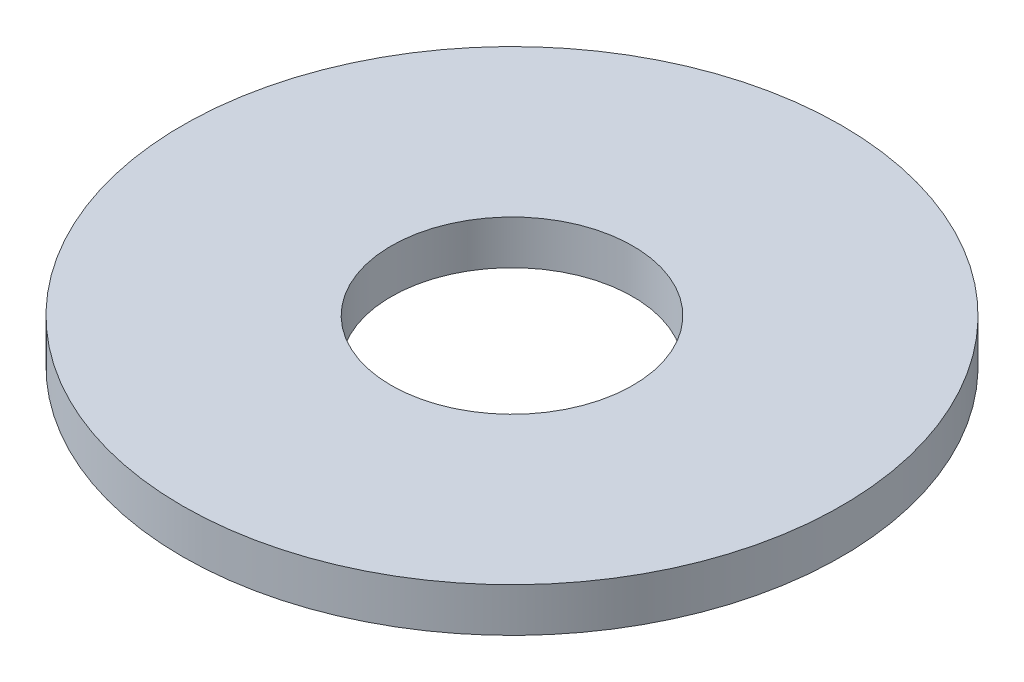
ISO-10303-21;
HEADER;
FILE_DESCRIPTION(('STEP AP214'),'2;1');
FILE_NAME('part.step','',(''),(''),'','','');
FILE_SCHEMA(('AUTOMOTIVE_DESIGN { 1 0 10303 214 1 1 1 1 }'));
ENDSEC;
DATA;
#1=APPLICATION_CONTEXT('core data for automotive mechanical design processes');
#2=APPLICATION_PROTOCOL_DEFINITION('international standard','automotive_design',2000,#1);
#3=PRODUCT_CONTEXT('',#1,'mechanical');
#4=PRODUCT('Part','Part','',(#3));
#5=PRODUCT_RELATED_PRODUCT_CATEGORY('part','',(#4));
#6=PRODUCT_DEFINITION_FORMATION('','',#4);
#7=PRODUCT_DEFINITION_CONTEXT('part definition',#1,'design');
#8=PRODUCT_DEFINITION('design','',#6,#7);
#9=PRODUCT_DEFINITION_SHAPE('','',#8);
#10=(LENGTH_UNIT() NAMED_UNIT(*) SI_UNIT(.MILLI.,.METRE.));
#11=(NAMED_UNIT(*) PLANE_ANGLE_UNIT() SI_UNIT($,.RADIAN.));
#12=(NAMED_UNIT(*) SI_UNIT($,.STERADIAN.) SOLID_ANGLE_UNIT());
#13=UNCERTAINTY_MEASURE_WITH_UNIT(LENGTH_MEASURE(1.E-05),#10,'distance_accuracy_value','');
#14=(GEOMETRIC_REPRESENTATION_CONTEXT(3) GLOBAL_UNCERTAINTY_ASSIGNED_CONTEXT((#13)) GLOBAL_UNIT_ASSIGNED_CONTEXT((#10,
#11,#12)) REPRESENTATION_CONTEXT('',''));
#15=CARTESIAN_POINT('',(0.,0.,0.));
#16=DIRECTION('',(0.,0.,1.));
#17=DIRECTION('',(1.,0.,0.));
#18=AXIS2_PLACEMENT_3D('',#15,#16,#17);
#19=CARTESIAN_POINT('',(0.,1.,0.));
#20=DIRECTION('',(0.,1.,0.));
#21=DIRECTION('',(0.,0.,1.));
#22=AXIS2_PLACEMENT_3D('',#19,#20,#21);
#23=PLANE('',#22);
#24=CARTESIAN_POINT('',(0.,1.,0.));
#25=DIRECTION('',(0.,1.,0.));
#26=DIRECTION('',(0.,0.,1.));
#27=AXIS2_PLACEMENT_3D('',#24,#25,#26);
#28=CIRCLE('',#27,7.5);
#29=CARTESIAN_POINT('',(0.,1.,7.5));
#30=VERTEX_POINT('',#29);
#31=EDGE_CURVE('E10',#30,#30,#28,.T.);
#32=ORIENTED_EDGE('',*,*,#31,.T.);
#33=EDGE_LOOP('',(#32));
#34=FACE_BOUND('',#33,.T.);
#35=CARTESIAN_POINT('',(0.,1.,0.));
#36=DIRECTION('',(0.,1.,0.));
#37=DIRECTION('',(0.,0.,1.));
#38=AXIS2_PLACEMENT_3D('',#35,#36,#37);
#39=CIRCLE('',#38,2.75);
#40=CARTESIAN_POINT('',(0.,1.,2.75));
#41=VERTEX_POINT('',#40);
#42=EDGE_CURVE('E40',#41,#41,#39,.T.);
#43=ORIENTED_EDGE('',*,*,#42,.F.);
#44=EDGE_LOOP('',(#43));
#45=FACE_BOUND('',#44,.T.);
#46=ADVANCED_FACE('F29',(#34,#45),#23,.T.);
#47=CARTESIAN_POINT('',(0.,0.,0.));
#48=DIRECTION('',(0.,1.,0.));
#49=DIRECTION('',(0.,0.,1.));
#50=AXIS2_PLACEMENT_3D('',#47,#48,#49);
#51=PLANE('',#50);
#52=CARTESIAN_POINT('',(0.,0.,0.));
#53=DIRECTION('',(0.,1.,0.));
#54=DIRECTION('',(0.,0.,1.));
#55=AXIS2_PLACEMENT_3D('',#52,#53,#54);
#56=CIRCLE('',#55,7.5);
#57=CARTESIAN_POINT('',(0.,0.,7.5));
#58=VERTEX_POINT('',#57);
#59=EDGE_CURVE('E33',#58,#58,#56,.T.);
#60=ORIENTED_EDGE('',*,*,#59,.F.);
#61=EDGE_LOOP('',(#60));
#62=FACE_BOUND('',#61,.T.);
#63=CARTESIAN_POINT('',(0.,0.,0.));
#64=DIRECTION('',(0.,1.,0.));
#65=DIRECTION('',(0.,0.,1.));
#66=AXIS2_PLACEMENT_3D('',#63,#64,#65);
#67=CIRCLE('',#66,2.75);
#68=CARTESIAN_POINT('',(0.,0.,2.75));
#69=VERTEX_POINT('',#68);
#70=EDGE_CURVE('E42',#69,#69,#67,.T.);
#71=ORIENTED_EDGE('',*,*,#70,.T.);
#72=EDGE_LOOP('',(#71));
#73=FACE_BOUND('',#72,.T.);
#74=ADVANCED_FACE('F52',(#62,#73),#51,.F.);
#75=CARTESIAN_POINT('',(0.,1.,0.));
#76=DIRECTION('',(0.,-1.,0.));
#77=DIRECTION('',(0.,0.,-1.));
#78=AXIS2_PLACEMENT_3D('',#75,#76,#77);
#79=CYLINDRICAL_SURFACE('',#78,7.5);
#80=ORIENTED_EDGE('',*,*,#31,.F.);
#81=EDGE_LOOP('',(#80));
#82=FACE_BOUND('',#81,.T.);
#83=ORIENTED_EDGE('',*,*,#59,.T.);
#84=EDGE_LOOP('',(#83));
#85=FACE_BOUND('',#84,.T.);
#86=ADVANCED_FACE('F31',(#82,#85),#79,.T.);
#87=CARTESIAN_POINT('',(0.,1.,0.));
#88=DIRECTION('',(0.,-1.,0.));
#89=DIRECTION('',(0.,0.,-1.));
#90=AXIS2_PLACEMENT_3D('',#87,#88,#89);
#91=CYLINDRICAL_SURFACE('',#90,2.75);
#92=ORIENTED_EDGE('',*,*,#42,.T.);
#93=EDGE_LOOP('',(#92));
#94=FACE_BOUND('',#93,.T.);
#95=ORIENTED_EDGE('',*,*,#70,.F.);
#96=EDGE_LOOP('',(#95));
#97=FACE_BOUND('',#96,.T.);
#98=ADVANCED_FACE('F48',(#94,#97),#91,.F.);
#99=CLOSED_SHELL('',(#46,#74,#86,#98));
#100=MANIFOLD_SOLID_BREP('B2',#99);
#101=ADVANCED_BREP_SHAPE_REPRESENTATION('',(#18,#100),#14);
#102=SHAPE_DEFINITION_REPRESENTATION(#9,#101);
ENDSEC;
END-ISO-10303-21;
